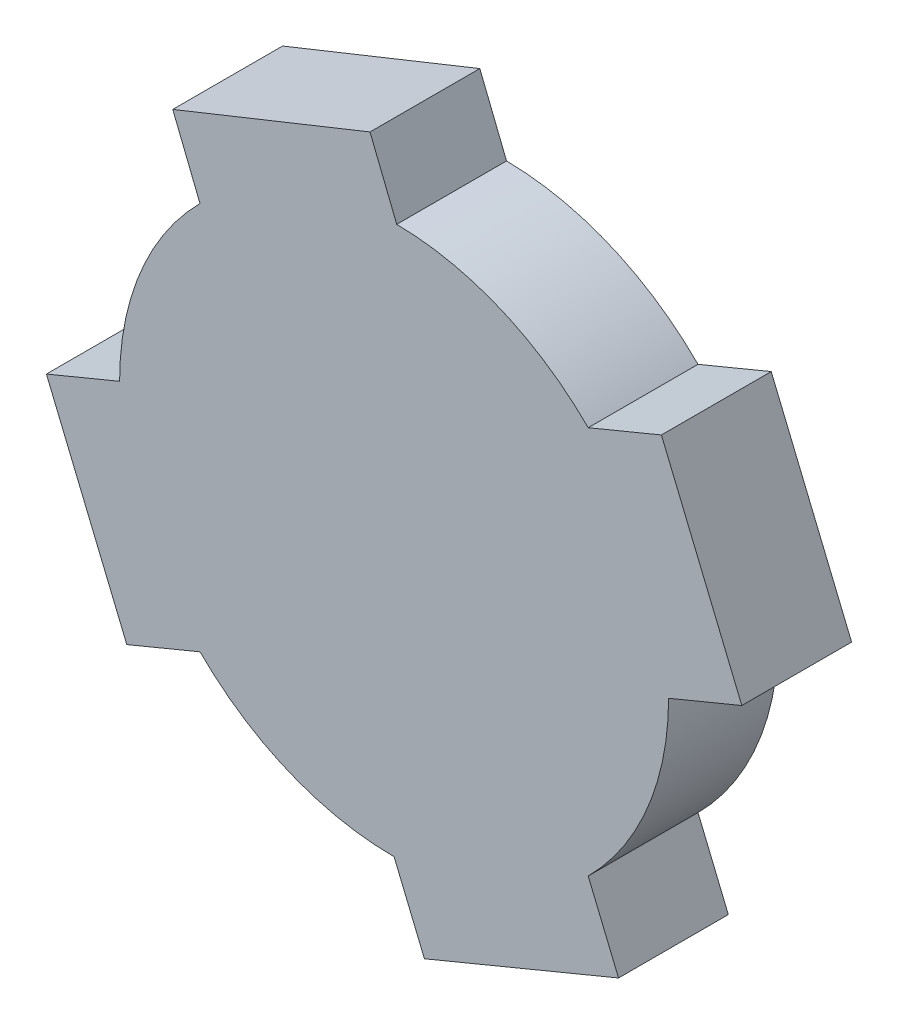
ISO-10303-21;
HEADER;
FILE_DESCRIPTION(('STEP AP214'),'2;1');
FILE_NAME('part.step','',(''),(''),'','','');
FILE_SCHEMA(('AUTOMOTIVE_DESIGN { 1 0 10303 214 1 1 1 1 }'));
ENDSEC;
DATA;
#1=APPLICATION_CONTEXT('core data for automotive mechanical design processes');
#2=APPLICATION_PROTOCOL_DEFINITION('international standard','automotive_design',2000,#1);
#3=PRODUCT_CONTEXT('',#1,'mechanical');
#4=PRODUCT('Part','Part','',(#3));
#5=PRODUCT_RELATED_PRODUCT_CATEGORY('part','',(#4));
#6=PRODUCT_DEFINITION_FORMATION('','',#4);
#7=PRODUCT_DEFINITION_CONTEXT('part definition',#1,'design');
#8=PRODUCT_DEFINITION('design','',#6,#7);
#9=PRODUCT_DEFINITION_SHAPE('','',#8);
#10=(LENGTH_UNIT() NAMED_UNIT(*) SI_UNIT(.MILLI.,.METRE.));
#11=(NAMED_UNIT(*) PLANE_ANGLE_UNIT() SI_UNIT($,.RADIAN.));
#12=(NAMED_UNIT(*) SI_UNIT($,.STERADIAN.) SOLID_ANGLE_UNIT());
#13=UNCERTAINTY_MEASURE_WITH_UNIT(LENGTH_MEASURE(1.E-05),#10,'distance_accuracy_value','');
#14=(GEOMETRIC_REPRESENTATION_CONTEXT(3) GLOBAL_UNCERTAINTY_ASSIGNED_CONTEXT((#13)) GLOBAL_UNIT_ASSIGNED_CONTEXT((#10,
#11,#12)) REPRESENTATION_CONTEXT('',''));
#15=CARTESIAN_POINT('',(0.,0.,0.));
#16=DIRECTION('',(0.,0.,1.));
#17=DIRECTION('',(1.,0.,0.));
#18=AXIS2_PLACEMENT_3D('',#15,#16,#17);
#19=CARTESIAN_POINT('',(0.,0.,30.));
#20=DIRECTION('',(0.,0.,-1.));
#21=DIRECTION('',(-1.,0.,0.));
#22=AXIS2_PLACEMENT_3D('',#19,#20,#21);
#23=CYLINDRICAL_SURFACE('',#22,75.);
#24=DIRECTION('',(0.,0.,1.));
#25=VECTOR('',#24,1.);
#26=CARTESIAN_POINT('',(-53.0330085889917,53.0330085889904,-74.3036821068354));
#27=LINE('',#26,#25);
#28=CARTESIAN_POINT('',(-53.0330085889916,53.0330085889904,0.));
#29=VERTEX_POINT('',#28);
#30=CARTESIAN_POINT('',(-53.0330085889917,53.0330085889905,30.));
#31=VERTEX_POINT('',#30);
#32=EDGE_CURVE('E186',#29,#31,#27,.T.);
#33=ORIENTED_EDGE('',*,*,#32,.F.);
#34=CARTESIAN_POINT('',(0.,0.,0.));
#35=DIRECTION('',(0.,0.,1.));
#36=DIRECTION('',(1.,0.,0.));
#37=AXIS2_PLACEMENT_3D('',#34,#35,#36);
#38=CIRCLE('',#37,75.);
#39=CARTESIAN_POINT('',(-75.,-9.54097911787244E-13,0.));
#40=VERTEX_POINT('',#39);
#41=EDGE_CURVE('E290',#29,#40,#38,.T.);
#42=ORIENTED_EDGE('',*,*,#41,.T.);
#43=DIRECTION('',(0.,0.,1.));
#44=VECTOR('',#43,1.);
#45=CARTESIAN_POINT('',(-75.,-9.54097911787244E-13,-74.3036821068354));
#46=LINE('',#45,#44);
#47=CARTESIAN_POINT('',(-75.,-9.54097911787244E-13,30.));
#48=VERTEX_POINT('',#47);
#49=EDGE_CURVE('E211',#40,#48,#46,.T.);
#50=ORIENTED_EDGE('',*,*,#49,.T.);
#51=CARTESIAN_POINT('',(0.,0.,30.));
#52=DIRECTION('',(0.,0.,1.));
#53=DIRECTION('',(1.,0.,0.));
#54=AXIS2_PLACEMENT_3D('',#51,#52,#53);
#55=CIRCLE('',#54,75.);
#56=EDGE_CURVE('E51',#31,#48,#55,.T.);
#57=ORIENTED_EDGE('',*,*,#56,.F.);
#58=EDGE_LOOP('',(#33,#42,#50,#57));
#59=FACE_BOUND('',#58,.T.);
#60=ADVANCED_FACE('F41',(#59),#23,.T.);
#61=DIRECTION('',(0.,0.,1.));
#62=VECTOR('',#61,1.);
#63=CARTESIAN_POINT('',(-53.0330085889904,-53.0330085889918,-74.3036821068354));
#64=LINE('',#63,#62);
#65=CARTESIAN_POINT('',(-53.0330085889904,-53.0330085889918,0.));
#66=VERTEX_POINT('',#65);
#67=CARTESIAN_POINT('',(-53.0330085889904,-53.0330085889918,30.));
#68=VERTEX_POINT('',#67);
#69=EDGE_CURVE('E213',#66,#68,#64,.T.);
#70=ORIENTED_EDGE('',*,*,#69,.F.);
#71=CARTESIAN_POINT('',(9.54097911787244E-13,-75.,0.));
#72=VERTEX_POINT('',#71);
#73=EDGE_CURVE('E252',#66,#72,#38,.T.);
#74=ORIENTED_EDGE('',*,*,#73,.T.);
#75=DIRECTION('',(0.,0.,1.));
#76=VECTOR('',#75,1.);
#77=CARTESIAN_POINT('',(9.54097911787244E-13,-75.,-74.3036821068354));
#78=LINE('',#77,#76);
#79=CARTESIAN_POINT('',(9.54097911787244E-13,-75.,30.));
#80=VERTEX_POINT('',#79);
#81=EDGE_CURVE('E264',#72,#80,#78,.T.);
#82=ORIENTED_EDGE('',*,*,#81,.T.);
#83=EDGE_CURVE('E293',#68,#80,#55,.T.);
#84=ORIENTED_EDGE('',*,*,#83,.F.);
#85=EDGE_LOOP('',(#70,#74,#82,#84));
#86=FACE_BOUND('',#85,.T.);
#87=ADVANCED_FACE('F292',(#86),#23,.T.);
#88=CARTESIAN_POINT('',(53.0330085889905,53.0330085889917,0.));
#89=VERTEX_POINT('',#88);
#90=CARTESIAN_POINT('',(0.719763670810433,74.9965461888625,0.));
#91=VERTEX_POINT('',#90);
#92=EDGE_CURVE('E291',#89,#91,#38,.T.);
#93=ORIENTED_EDGE('',*,*,#92,.T.);
#94=DIRECTION('',(0.,0.,1.));
#95=VECTOR('',#94,1.);
#96=CARTESIAN_POINT('',(0.719763670810433,74.9965461888625,-74.3036821068354));
#97=LINE('',#96,#95);
#98=CARTESIAN_POINT('',(0.719763670810433,74.9965461888625,30.));
#99=VERTEX_POINT('',#98);
#100=EDGE_CURVE('E65',#91,#99,#97,.T.);
#101=ORIENTED_EDGE('',*,*,#100,.T.);
#102=CARTESIAN_POINT('',(53.0330085889905,53.0330085889917,30.));
#103=VERTEX_POINT('',#102);
#104=EDGE_CURVE('E50',#103,#99,#55,.T.);
#105=ORIENTED_EDGE('',*,*,#104,.F.);
#106=DIRECTION('',(0.,0.,1.));
#107=VECTOR('',#106,1.);
#108=CARTESIAN_POINT('',(53.0330085889905,53.0330085889917,-74.3036821068354));
#109=LINE('',#108,#107);
#110=EDGE_CURVE('E237',#89,#103,#109,.T.);
#111=ORIENTED_EDGE('',*,*,#110,.F.);
#112=EDGE_LOOP('',(#93,#101,#105,#111));
#113=FACE_BOUND('',#112,.T.);
#114=ADVANCED_FACE('F313',(#113),#23,.T.);
#115=CARTESIAN_POINT('',(53.0330085889918,-53.0330085889904,0.));
#116=VERTEX_POINT('',#115);
#117=CARTESIAN_POINT('',(75.,0.,0.));
#118=VERTEX_POINT('',#117);
#119=EDGE_CURVE('E45',#116,#118,#38,.T.);
#120=ORIENTED_EDGE('',*,*,#119,.T.);
#121=DIRECTION('',(0.,0.,1.));
#122=VECTOR('',#121,1.);
#123=CARTESIAN_POINT('',(75.,8.50014503228635E-13,-74.3036821068354));
#124=LINE('',#123,#122);
#125=CARTESIAN_POINT('',(75.,0.,30.));
#126=VERTEX_POINT('',#125);
#127=EDGE_CURVE('E223',#118,#126,#124,.T.);
#128=ORIENTED_EDGE('',*,*,#127,.T.);
#129=CARTESIAN_POINT('',(53.0330085889918,-53.0330085889904,30.));
#130=VERTEX_POINT('',#129);
#131=EDGE_CURVE('E11',#130,#126,#55,.T.);
#132=ORIENTED_EDGE('',*,*,#131,.F.);
#133=DIRECTION('',(0.,0.,1.));
#134=VECTOR('',#133,1.);
#135=CARTESIAN_POINT('',(53.0330085889918,-53.0330085889904,-74.3036821068354));
#136=LINE('',#135,#134);
#137=EDGE_CURVE('E267',#116,#130,#136,.T.);
#138=ORIENTED_EDGE('',*,*,#137,.F.);
#139=EDGE_LOOP('',(#120,#128,#132,#138));
#140=FACE_BOUND('',#139,.T.);
#141=ADVANCED_FACE('F43',(#140),#23,.T.);
#142=CARTESIAN_POINT('',(0.,0.,30.));
#143=DIRECTION('',(0.,0.,1.));
#144=DIRECTION('',(1.,0.,0.));
#145=AXIS2_PLACEMENT_3D('',#142,#143,#144);
#146=PLANE('',#145);
#147=ORIENTED_EDGE('',*,*,#131,.T.);
#148=DIRECTION('',(0.923879532511281,0.382683432365103,0.));
#149=VECTOR('',#148,1.);
#150=CARTESIAN_POINT('',(10.9834957055049,-26.5165042944956,30.));
#151=LINE('',#150,#149);
#152=CARTESIAN_POINT('',(95.,8.28427124746311,30.));
#153=VERTEX_POINT('',#152);
#154=EDGE_CURVE('E199',#126,#153,#151,.T.);
#155=ORIENTED_EDGE('',*,*,#154,.T.);
#156=DIRECTION('',(-0.3826834323651,0.923879532511283,0.));
#157=VECTOR('',#156,1.);
#158=CARTESIAN_POINT('',(84.0165042944953,34.8007755419584,30.));
#159=LINE('',#158,#157);
#160=CARTESIAN_POINT('',(73.0330085889905,61.3172798364539,30.));
#161=VERTEX_POINT('',#160);
#162=EDGE_CURVE('E229',#153,#161,#159,.T.);
#163=ORIENTED_EDGE('',*,*,#162,.T.);
#164=DIRECTION('',(0.923879532511282,0.382683432365103,0.));
#165=VECTOR('',#164,1.);
#166=CARTESIAN_POINT('',(-10.9834957055048,26.5165042944952,30.));
#167=LINE('',#166,#165);
#168=EDGE_CURVE('E232',#103,#161,#167,.T.);
#169=ORIENTED_EDGE('',*,*,#168,.F.);
#170=ORIENTED_EDGE('',*,*,#104,.T.);
#171=DIRECTION('',(-0.372168182475181,0.928165310681842,0.));
#172=VECTOR('',#171,1.);
#173=CARTESIAN_POINT('',(26.5263965032826,10.6363388726415,30.));
#174=LINE('',#173,#172);
#175=CARTESIAN_POINT('',(-6.58190730991409,93.2064793143863,30.));
#176=VERTEX_POINT('',#175);
#177=EDGE_CURVE('E161',#99,#176,#174,.T.);
#178=ORIENTED_EDGE('',*,*,#177,.T.);
#179=DIRECTION('',(-0.928165310681842,-0.372168182475181,0.));
#180=VECTOR('',#179,1.);
#181=CARTESIAN_POINT('',(-33.1083038131968,82.5701404417447,30.));
#182=LINE('',#181,#180);
#183=CARTESIAN_POINT('',(-60.4763722384953,71.5963148026273,30.));
#184=VERTEX_POINT('',#183);
#185=EDGE_CURVE('E170',#176,#184,#182,.T.);
#186=ORIENTED_EDGE('',*,*,#185,.T.);
#187=DIRECTION('',(-0.372168182475182,0.928165310681842,0.));
#188=VECTOR('',#187,1.);
#189=CARTESIAN_POINT('',(-27.3680684252984,-10.9738256391174,30.));
#190=LINE('',#189,#188);
#191=EDGE_CURVE('E167',#31,#184,#190,.T.);
#192=ORIENTED_EDGE('',*,*,#191,.F.);
#193=ORIENTED_EDGE('',*,*,#56,.T.);
#194=DIRECTION('',(-0.923879532511282,-0.382683432365103,0.));
#195=VECTOR('',#194,1.);
#196=CARTESIAN_POINT('',(-10.9834957055049,26.5165042944956,30.));
#197=LINE('',#196,#195);
#198=CARTESIAN_POINT('',(-95.,-8.28427124746307,30.));
#199=VERTEX_POINT('',#198);
#200=EDGE_CURVE('E205',#48,#199,#197,.T.);
#201=ORIENTED_EDGE('',*,*,#200,.T.);
#202=DIRECTION('',(-0.3826834323651,0.923879532511283,0.));
#203=VECTOR('',#202,1.);
#204=CARTESIAN_POINT('',(-84.0165042944952,-34.8007755419584,30.));
#205=LINE('',#204,#203);
#206=CARTESIAN_POINT('',(-73.0330085889905,-61.3172798364539,30.));
#207=VERTEX_POINT('',#206);
#208=EDGE_CURVE('E191',#207,#199,#205,.T.);
#209=ORIENTED_EDGE('',*,*,#208,.F.);
#210=DIRECTION('',(-0.923879532511282,-0.382683432365102,0.));
#211=VECTOR('',#210,1.);
#212=CARTESIAN_POINT('',(10.9834957055048,-26.5165042944952,30.));
#213=LINE('',#212,#211);
#214=EDGE_CURVE('E202',#68,#207,#213,.T.);
#215=ORIENTED_EDGE('',*,*,#214,.F.);
#216=ORIENTED_EDGE('',*,*,#83,.T.);
#217=DIRECTION('',(0.382683432365104,-0.923879532511281,0.));
#218=VECTOR('',#217,1.);
#219=CARTESIAN_POINT('',(-26.5165042944956,-10.983495705505,30.));
#220=LINE('',#219,#218);
#221=CARTESIAN_POINT('',(8.2842712474631,-95.,30.));
#222=VERTEX_POINT('',#221);
#223=EDGE_CURVE('E258',#80,#222,#220,.T.);
#224=ORIENTED_EDGE('',*,*,#223,.T.);
#225=DIRECTION('',(-0.923879532511282,-0.3826834323651,0.));
#226=VECTOR('',#225,1.);
#227=CARTESIAN_POINT('',(34.8007755419584,-84.0165042944952,30.));
#228=LINE('',#227,#226);
#229=CARTESIAN_POINT('',(61.3172798364539,-73.0330085889904,30.));
#230=VERTEX_POINT('',#229);
#231=EDGE_CURVE('E244',#230,#222,#228,.T.);
#232=ORIENTED_EDGE('',*,*,#231,.F.);
#233=DIRECTION('',(0.382683432365103,-0.923879532511281,0.));
#234=VECTOR('',#233,1.);
#235=CARTESIAN_POINT('',(26.5165042944952,10.9834957055048,30.));
#236=LINE('',#235,#234);
#237=EDGE_CURVE('E255',#130,#230,#236,.T.);
#238=ORIENTED_EDGE('',*,*,#237,.F.);
#239=EDGE_LOOP('',(#147,#155,#163,#169,#170,#178,#186,#192,#193,#201,#209,#215,#216,#224,#232,#238));
#240=FACE_BOUND('',#239,.T.);
#241=ADVANCED_FACE('F177',(#240),#146,.T.);
#242=CARTESIAN_POINT('',(0.,0.,0.));
#243=DIRECTION('',(0.,0.,1.));
#244=DIRECTION('',(1.,0.,0.));
#245=AXIS2_PLACEMENT_3D('',#242,#243,#244);
#246=PLANE('',#245);
#247=ORIENTED_EDGE('',*,*,#119,.F.);
#248=DIRECTION('',(-0.382683432365103,0.923879532511281,0.));
#249=VECTOR('',#248,1.);
#250=CARTESIAN_POINT('',(26.5165042944952,10.9834957055048,0.));
#251=LINE('',#250,#249);
#252=CARTESIAN_POINT('',(61.3172798364539,-73.0330085889904,0.));
#253=VERTEX_POINT('',#252);
#254=EDGE_CURVE('E249',#253,#116,#251,.T.);
#255=ORIENTED_EDGE('',*,*,#254,.F.);
#256=DIRECTION('',(0.923879532511283,0.382683432365101,0.));
#257=VECTOR('',#256,1.);
#258=CARTESIAN_POINT('',(34.8007755419584,-84.0165042944952,0.));
#259=LINE('',#258,#257);
#260=CARTESIAN_POINT('',(8.2842712474631,-95.,0.));
#261=VERTEX_POINT('',#260);
#262=EDGE_CURVE('E248',#261,#253,#259,.T.);
#263=ORIENTED_EDGE('',*,*,#262,.F.);
#264=DIRECTION('',(-0.382683432365104,0.923879532511281,0.));
#265=VECTOR('',#264,1.);
#266=CARTESIAN_POINT('',(-26.5165042944956,-10.983495705505,0.));
#267=LINE('',#266,#265);
#268=EDGE_CURVE('E245',#261,#72,#267,.T.);
#269=ORIENTED_EDGE('',*,*,#268,.T.);
#270=ORIENTED_EDGE('',*,*,#73,.F.);
#271=DIRECTION('',(0.923879532511282,0.382683432365102,0.));
#272=VECTOR('',#271,1.);
#273=CARTESIAN_POINT('',(10.9834957055048,-26.5165042944952,0.));
#274=LINE('',#273,#272);
#275=CARTESIAN_POINT('',(-73.0330085889905,-61.3172798364539,0.));
#276=VERTEX_POINT('',#275);
#277=EDGE_CURVE('E196',#276,#66,#274,.T.);
#278=ORIENTED_EDGE('',*,*,#277,.F.);
#279=DIRECTION('',(0.3826834323651,-0.923879532511283,0.));
#280=VECTOR('',#279,1.);
#281=CARTESIAN_POINT('',(-84.0165042944952,-34.8007755419584,0.));
#282=LINE('',#281,#280);
#283=CARTESIAN_POINT('',(-95.,-8.28427124746307,0.));
#284=VERTEX_POINT('',#283);
#285=EDGE_CURVE('E195',#284,#276,#282,.T.);
#286=ORIENTED_EDGE('',*,*,#285,.F.);
#287=DIRECTION('',(0.923879532511281,0.382683432365103,0.));
#288=VECTOR('',#287,1.);
#289=CARTESIAN_POINT('',(-10.9834957055049,26.5165042944956,0.));
#290=LINE('',#289,#288);
#291=EDGE_CURVE('E192',#284,#40,#290,.T.);
#292=ORIENTED_EDGE('',*,*,#291,.T.);
#293=ORIENTED_EDGE('',*,*,#41,.F.);
#294=DIRECTION('',(0.372168182475182,-0.928165310681841,0.));
#295=VECTOR('',#294,1.);
#296=CARTESIAN_POINT('',(-27.3680684252984,-10.9738256391174,0.));
#297=LINE('',#296,#295);
#298=CARTESIAN_POINT('',(-60.4763722384953,71.5963148026273,0.));
#299=VERTEX_POINT('',#298);
#300=EDGE_CURVE('E185',#299,#29,#297,.T.);
#301=ORIENTED_EDGE('',*,*,#300,.F.);
#302=DIRECTION('',(0.928165310681842,0.372168182475181,0.));
#303=VECTOR('',#302,1.);
#304=CARTESIAN_POINT('',(-33.1083038131968,82.5701404417447,0.));
#305=LINE('',#304,#303);
#306=CARTESIAN_POINT('',(-6.58190730991409,93.2064793143862,0.));
#307=VERTEX_POINT('',#306);
#308=EDGE_CURVE('E189',#299,#307,#305,.T.);
#309=ORIENTED_EDGE('',*,*,#308,.T.);
#310=DIRECTION('',(0.372168182475181,-0.928165310681842,0.));
#311=VECTOR('',#310,1.);
#312=CARTESIAN_POINT('',(26.5263965032826,10.6363388726415,0.));
#313=LINE('',#312,#311);
#314=EDGE_CURVE('E163',#307,#91,#313,.T.);
#315=ORIENTED_EDGE('',*,*,#314,.T.);
#316=ORIENTED_EDGE('',*,*,#92,.F.);
#317=DIRECTION('',(-0.923879532511281,-0.382683432365103,0.));
#318=VECTOR('',#317,1.);
#319=CARTESIAN_POINT('',(-10.9834957055048,26.5165042944952,0.));
#320=LINE('',#319,#318);
#321=CARTESIAN_POINT('',(73.0330085889905,61.3172798364539,0.));
#322=VERTEX_POINT('',#321);
#323=EDGE_CURVE('E219',#322,#89,#320,.T.);
#324=ORIENTED_EDGE('',*,*,#323,.F.);
#325=DIRECTION('',(0.3826834323651,-0.923879532511282,0.));
#326=VECTOR('',#325,1.);
#327=CARTESIAN_POINT('',(84.0165042944953,34.8007755419584,0.));
#328=LINE('',#327,#326);
#329=CARTESIAN_POINT('',(95.,8.28427124746312,0.));
#330=VERTEX_POINT('',#329);
#331=EDGE_CURVE('E226',#322,#330,#328,.T.);
#332=ORIENTED_EDGE('',*,*,#331,.T.);
#333=DIRECTION('',(-0.923879532511281,-0.382683432365103,0.));
#334=VECTOR('',#333,1.);
#335=CARTESIAN_POINT('',(10.9834957055049,-26.5165042944956,0.));
#336=LINE('',#335,#334);
#337=EDGE_CURVE('E222',#330,#118,#336,.T.);
#338=ORIENTED_EDGE('',*,*,#337,.T.);
#339=EDGE_LOOP('',(#247,#255,#263,#269,#270,#278,#286,#292,#293,#301,#309,#315,#316,#324,#332,#338));
#340=FACE_BOUND('',#339,.T.);
#341=ADVANCED_FACE('F278',(#340),#246,.F.);
#342=CARTESIAN_POINT('',(26.5165042944952,10.9834957055048,-74.3036821068354));
#343=DIRECTION('',(-0.923879532511281,-0.382683432365103,0.));
#344=DIRECTION('',(0.382683432365103,-0.923879532511281,0.));
#345=AXIS2_PLACEMENT_3D('',#342,#343,#344);
#346=PLANE('',#345);
#347=DIRECTION('',(0.,0.,1.));
#348=VECTOR('',#347,1.);
#349=CARTESIAN_POINT('',(61.3172798364539,-73.0330085889904,-74.3036821068354));
#350=LINE('',#349,#348);
#351=EDGE_CURVE('E261',#253,#230,#350,.T.);
#352=ORIENTED_EDGE('',*,*,#351,.F.);
#353=ORIENTED_EDGE('',*,*,#254,.T.);
#354=ORIENTED_EDGE('',*,*,#137,.T.);
#355=ORIENTED_EDGE('',*,*,#237,.T.);
#356=EDGE_LOOP('',(#352,#353,#354,#355));
#357=FACE_BOUND('',#356,.T.);
#358=ADVANCED_FACE('F274',(#357),#346,.F.);
#359=CARTESIAN_POINT('',(-26.5165042944956,-10.983495705505,-74.3036821068354));
#360=DIRECTION('',(-0.923879532511281,-0.382683432365104,0.));
#361=DIRECTION('',(0.382683432365104,-0.923879532511281,0.));
#362=AXIS2_PLACEMENT_3D('',#359,#360,#361);
#363=PLANE('',#362);
#364=ORIENTED_EDGE('',*,*,#268,.F.);
#365=DIRECTION('',(0.,0.,1.));
#366=VECTOR('',#365,1.);
#367=CARTESIAN_POINT('',(8.2842712474631,-95.,-74.3036821068354));
#368=LINE('',#367,#366);
#369=EDGE_CURVE('E262',#261,#222,#368,.T.);
#370=ORIENTED_EDGE('',*,*,#369,.T.);
#371=ORIENTED_EDGE('',*,*,#223,.F.);
#372=ORIENTED_EDGE('',*,*,#81,.F.);
#373=EDGE_LOOP('',(#364,#370,#371,#372));
#374=FACE_BOUND('',#373,.T.);
#375=ADVANCED_FACE('F287',(#374),#363,.T.);
#376=CARTESIAN_POINT('',(34.8007755419584,-84.0165042944952,-74.3036821068354));
#377=DIRECTION('',(-0.3826834323651,0.923879532511282,0.));
#378=DIRECTION('',(-0.923879532511283,-0.382683432365101,0.));
#379=AXIS2_PLACEMENT_3D('',#376,#377,#378);
#380=PLANE('',#379);
#381=ORIENTED_EDGE('',*,*,#369,.F.);
#382=ORIENTED_EDGE('',*,*,#262,.T.);
#383=ORIENTED_EDGE('',*,*,#351,.T.);
#384=ORIENTED_EDGE('',*,*,#231,.T.);
#385=EDGE_LOOP('',(#381,#382,#383,#384));
#386=FACE_BOUND('',#385,.T.);
#387=ADVANCED_FACE('F281',(#386),#380,.F.);
#388=CARTESIAN_POINT('',(10.9834957055049,-26.5165042944956,-74.3036821068354));
#389=DIRECTION('',(0.382683432365103,-0.923879532511281,0.));
#390=DIRECTION('',(0.923879532511281,0.382683432365103,0.));
#391=AXIS2_PLACEMENT_3D('',#388,#389,#390);
#392=PLANE('',#391);
#393=ORIENTED_EDGE('',*,*,#337,.F.);
#394=DIRECTION('',(0.,0.,1.));
#395=VECTOR('',#394,1.);
#396=CARTESIAN_POINT('',(95.,8.28427124746311,-74.3036821068354));
#397=LINE('',#396,#395);
#398=EDGE_CURVE('E235',#330,#153,#397,.T.);
#399=ORIENTED_EDGE('',*,*,#398,.T.);
#400=ORIENTED_EDGE('',*,*,#154,.F.);
#401=ORIENTED_EDGE('',*,*,#127,.F.);
#402=EDGE_LOOP('',(#393,#399,#400,#401));
#403=FACE_BOUND('',#402,.T.);
#404=ADVANCED_FACE('F324',(#403),#392,.T.);
#405=CARTESIAN_POINT('',(-10.9834957055048,26.5165042944952,-74.3036821068354));
#406=DIRECTION('',(0.382683432365103,-0.923879532511281,0.));
#407=DIRECTION('',(0.923879532511281,0.382683432365103,0.));
#408=AXIS2_PLACEMENT_3D('',#405,#406,#407);
#409=PLANE('',#408);
#410=DIRECTION('',(0.,0.,1.));
#411=VECTOR('',#410,1.);
#412=CARTESIAN_POINT('',(73.0330085889905,61.3172798364539,-74.3036821068354));
#413=LINE('',#412,#411);
#414=EDGE_CURVE('E240',#322,#161,#413,.T.);
#415=ORIENTED_EDGE('',*,*,#414,.F.);
#416=ORIENTED_EDGE('',*,*,#323,.T.);
#417=ORIENTED_EDGE('',*,*,#110,.T.);
#418=ORIENTED_EDGE('',*,*,#168,.T.);
#419=EDGE_LOOP('',(#415,#416,#417,#418));
#420=FACE_BOUND('',#419,.T.);
#421=ADVANCED_FACE('F315',(#420),#409,.F.);
#422=CARTESIAN_POINT('',(84.0165042944953,34.8007755419584,-74.3036821068354));
#423=DIRECTION('',(0.923879532511283,0.3826834323651,0.));
#424=DIRECTION('',(-0.3826834323651,0.923879532511282,0.));
#425=AXIS2_PLACEMENT_3D('',#422,#423,#424);
#426=PLANE('',#425);
#427=ORIENTED_EDGE('',*,*,#331,.F.);
#428=ORIENTED_EDGE('',*,*,#414,.T.);
#429=ORIENTED_EDGE('',*,*,#162,.F.);
#430=ORIENTED_EDGE('',*,*,#398,.F.);
#431=EDGE_LOOP('',(#427,#428,#429,#430));
#432=FACE_BOUND('',#431,.T.);
#433=ADVANCED_FACE('F320',(#432),#426,.T.);
#434=CARTESIAN_POINT('',(10.9834957055048,-26.5165042944952,-74.3036821068354));
#435=DIRECTION('',(-0.382683432365102,0.923879532511282,0.));
#436=DIRECTION('',(-0.923879532511282,-0.382683432365102,0.));
#437=AXIS2_PLACEMENT_3D('',#434,#435,#436);
#438=PLANE('',#437);
#439=DIRECTION('',(0.,0.,1.));
#440=VECTOR('',#439,1.);
#441=CARTESIAN_POINT('',(-73.0330085889905,-61.3172798364539,-74.3036821068354));
#442=LINE('',#441,#440);
#443=EDGE_CURVE('E208',#276,#207,#442,.T.);
#444=ORIENTED_EDGE('',*,*,#443,.F.);
#445=ORIENTED_EDGE('',*,*,#277,.T.);
#446=ORIENTED_EDGE('',*,*,#69,.T.);
#447=ORIENTED_EDGE('',*,*,#214,.T.);
#448=EDGE_LOOP('',(#444,#445,#446,#447));
#449=FACE_BOUND('',#448,.T.);
#450=ADVANCED_FACE('F297',(#449),#438,.F.);
#451=CARTESIAN_POINT('',(-10.9834957055049,26.5165042944956,-74.3036821068354));
#452=DIRECTION('',(-0.382683432365103,0.923879532511281,0.));
#453=DIRECTION('',(-0.923879532511281,-0.382683432365103,0.));
#454=AXIS2_PLACEMENT_3D('',#451,#452,#453);
#455=PLANE('',#454);
#456=ORIENTED_EDGE('',*,*,#291,.F.);
#457=DIRECTION('',(0.,0.,1.));
#458=VECTOR('',#457,1.);
#459=CARTESIAN_POINT('',(-95.,-8.28427124746307,-74.3036821068354));
#460=LINE('',#459,#458);
#461=EDGE_CURVE('E209',#284,#199,#460,.T.);
#462=ORIENTED_EDGE('',*,*,#461,.T.);
#463=ORIENTED_EDGE('',*,*,#200,.F.);
#464=ORIENTED_EDGE('',*,*,#49,.F.);
#465=EDGE_LOOP('',(#456,#462,#463,#464));
#466=FACE_BOUND('',#465,.T.);
#467=ADVANCED_FACE('F306',(#466),#455,.T.);
#468=CARTESIAN_POINT('',(-84.0165042944952,-34.8007755419584,-74.3036821068354));
#469=DIRECTION('',(0.923879532511283,0.3826834323651,0.));
#470=DIRECTION('',(-0.3826834323651,0.923879532511283,0.));
#471=AXIS2_PLACEMENT_3D('',#468,#469,#470);
#472=PLANE('',#471);
#473=ORIENTED_EDGE('',*,*,#461,.F.);
#474=ORIENTED_EDGE('',*,*,#285,.T.);
#475=ORIENTED_EDGE('',*,*,#443,.T.);
#476=ORIENTED_EDGE('',*,*,#208,.T.);
#477=EDGE_LOOP('',(#473,#474,#475,#476));
#478=FACE_BOUND('',#477,.T.);
#479=ADVANCED_FACE('F301',(#478),#472,.F.);
#480=CARTESIAN_POINT('',(26.5263965032826,10.6363388726415,-74.3036821068354));
#481=DIRECTION('',(0.928165310681842,0.372168182475181,0.));
#482=DIRECTION('',(-0.372168182475181,0.928165310681842,0.));
#483=AXIS2_PLACEMENT_3D('',#480,#481,#482);
#484=PLANE('',#483);
#485=ORIENTED_EDGE('',*,*,#314,.F.);
#486=DIRECTION('',(0.,0.,1.));
#487=VECTOR('',#486,1.);
#488=CARTESIAN_POINT('',(-6.58190730991409,93.2064793143863,-74.3036821068354));
#489=LINE('',#488,#487);
#490=EDGE_CURVE('E157',#307,#176,#489,.T.);
#491=ORIENTED_EDGE('',*,*,#490,.T.);
#492=ORIENTED_EDGE('',*,*,#177,.F.);
#493=ORIENTED_EDGE('',*,*,#100,.F.);
#494=EDGE_LOOP('',(#485,#491,#492,#493));
#495=FACE_BOUND('',#494,.T.);
#496=ADVANCED_FACE('F159',(#495),#484,.T.);
#497=CARTESIAN_POINT('',(-27.3680684252984,-10.9738256391174,-74.3036821068354));
#498=DIRECTION('',(0.928165310681841,0.372168182475182,0.));
#499=DIRECTION('',(-0.372168182475182,0.928165310681841,0.));
#500=AXIS2_PLACEMENT_3D('',#497,#498,#499);
#501=PLANE('',#500);
#502=DIRECTION('',(0.,0.,1.));
#503=VECTOR('',#502,1.);
#504=CARTESIAN_POINT('',(-60.4763722384953,71.5963148026273,-74.3036821068354));
#505=LINE('',#504,#503);
#506=EDGE_CURVE('E166',#299,#184,#505,.T.);
#507=ORIENTED_EDGE('',*,*,#506,.F.);
#508=ORIENTED_EDGE('',*,*,#300,.T.);
#509=ORIENTED_EDGE('',*,*,#32,.T.);
#510=ORIENTED_EDGE('',*,*,#191,.T.);
#511=EDGE_LOOP('',(#507,#508,#509,#510));
#512=FACE_BOUND('',#511,.T.);
#513=ADVANCED_FACE('F310',(#512),#501,.F.);
#514=CARTESIAN_POINT('',(-33.1083038131968,82.5701404417447,-74.3036821068354));
#515=DIRECTION('',(-0.372168182475181,0.928165310681842,0.));
#516=DIRECTION('',(-0.928165310681842,-0.372168182475181,0.));
#517=AXIS2_PLACEMENT_3D('',#514,#515,#516);
#518=PLANE('',#517);
#519=ORIENTED_EDGE('',*,*,#308,.F.);
#520=ORIENTED_EDGE('',*,*,#506,.T.);
#521=ORIENTED_EDGE('',*,*,#185,.F.);
#522=ORIENTED_EDGE('',*,*,#490,.F.);
#523=EDGE_LOOP('',(#519,#520,#521,#522));
#524=FACE_BOUND('',#523,.T.);
#525=ADVANCED_FACE('F171',(#524),#518,.T.);
#526=CLOSED_SHELL('',(#60,#87,#114,#141,#241,#341,#358,#375,#387,#404,#421,#433,#450,#467,#479,
#496,#513,#525));
#527=MANIFOLD_SOLID_BREP('B2',#526);
#528=ADVANCED_BREP_SHAPE_REPRESENTATION('',(#18,#527),#14);
#529=SHAPE_DEFINITION_REPRESENTATION(#9,#528);
ENDSEC;
END-ISO-10303-21;
